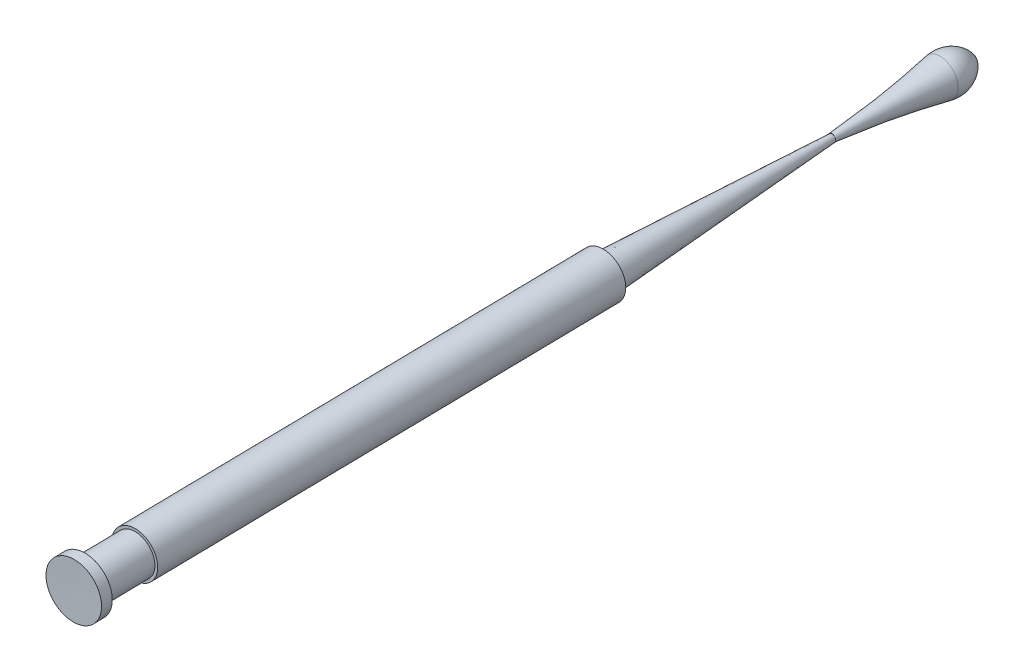
ISO-10303-21;
HEADER;
FILE_DESCRIPTION(('STEP AP214'),'2;1');
FILE_NAME('part.step','',(''),(''),'','','');
FILE_SCHEMA(('AUTOMOTIVE_DESIGN { 1 0 10303 214 1 1 1 1 }'));
ENDSEC;
DATA;
#1=APPLICATION_CONTEXT('core data for automotive mechanical design processes');
#2=APPLICATION_PROTOCOL_DEFINITION('international standard','automotive_design',2000,#1);
#3=PRODUCT_CONTEXT('',#1,'mechanical');
#4=PRODUCT('Part','Part','',(#3));
#5=PRODUCT_RELATED_PRODUCT_CATEGORY('part','',(#4));
#6=PRODUCT_DEFINITION_FORMATION('','',#4);
#7=PRODUCT_DEFINITION_CONTEXT('part definition',#1,'design');
#8=PRODUCT_DEFINITION('design','',#6,#7);
#9=PRODUCT_DEFINITION_SHAPE('','',#8);
#10=(LENGTH_UNIT() NAMED_UNIT(*) SI_UNIT(.MILLI.,.METRE.));
#11=(NAMED_UNIT(*) PLANE_ANGLE_UNIT() SI_UNIT($,.RADIAN.));
#12=(NAMED_UNIT(*) SI_UNIT($,.STERADIAN.) SOLID_ANGLE_UNIT());
#13=UNCERTAINTY_MEASURE_WITH_UNIT(LENGTH_MEASURE(1.E-05),#10,'distance_accuracy_value','');
#14=(GEOMETRIC_REPRESENTATION_CONTEXT(3) GLOBAL_UNCERTAINTY_ASSIGNED_CONTEXT((#13)) GLOBAL_UNIT_ASSIGNED_CONTEXT((#10,
#11,#12)) REPRESENTATION_CONTEXT('',''));
#15=CARTESIAN_POINT('',(0.,0.,0.));
#16=DIRECTION('',(0.,0.,1.));
#17=DIRECTION('',(1.,0.,0.));
#18=AXIS2_PLACEMENT_3D('',#15,#16,#17);
#19=CARTESIAN_POINT('',(-33.5350960608304,3.5,-10.8193182598972));
#20=DIRECTION('',(-0.016754376868981,0.,0.99985963557678));
#21=DIRECTION('',(0.99985963557678,0.,0.016754376868981));
#22=AXIS2_PLACEMENT_3D('',#19,#20,#21);
#23=TOROIDAL_SURFACE('',#22,134.673106625372,134.614867105977);
#24=CARTESIAN_POINT('',(-33.3529314814202,3.5,-21.6904483179336));
#25=DIRECTION('',(-0.016754376868981,0.,0.99985963557678));
#26=DIRECTION('',(0.99985963557678,0.,0.016754376868981));
#27=AXIS2_PLACEMENT_3D('',#24,#25,#26);
#28=CIRCLE('',#27,0.498042648166783);
#29=CARTESIAN_POINT('',(-32.8549587407225,3.5,-21.6821039237094));
#30=VERTEX_POINT('',#29);
#31=EDGE_CURVE('E12',#30,#30,#28,.T.);
#32=ORIENTED_EDGE('',*,*,#31,.F.);
#33=EDGE_LOOP('',(#32));
#34=FACE_BOUND('',#33,.T.);
#35=CARTESIAN_POINT('',(-33.1079160789345,3.5,-36.3123595328841));
#36=DIRECTION('',(-0.016754376868981,0.,0.99985963557678));
#37=DIRECTION('',(0.99985963557678,0.,0.016754376868981));
#38=AXIS2_PLACEMENT_3D('',#35,#36,#37);
#39=CIRCLE('',#38,2.49487539996673);
#40=CARTESIAN_POINT('',(-30.6133908707143,3.5,-36.2705594501919));
#41=VERTEX_POINT('',#40);
#42=EDGE_CURVE('E68',#41,#41,#39,.T.);
#43=ORIENTED_EDGE('',*,*,#42,.T.);
#44=EDGE_LOOP('',(#43));
#45=FACE_BOUND('',#44,.T.);
#46=ADVANCED_FACE('F45',(#34,#45),#23,.F.);
#47=CARTESIAN_POINT('',(-33.3529314814202,3.5,-21.6904483179336));
#48=DIRECTION('',(-0.016754376868981,0.,0.99985963557678));
#49=DIRECTION('',(0.99985963557678,0.,0.016754376868981));
#50=AXIS2_PLACEMENT_3D('',#47,#48,#49);
#51=CONICAL_SURFACE('',#50,0.49804264816678,1.55404116597575);
#52=CARTESIAN_POINT('',(-33.3527916566682,3.5,-21.6987927121578));
#53=VERTEX_POINT('',#52);
#54=VERTEX_LOOP('',#53);
#55=FACE_BOUND('',#54,.T.);
#56=ORIENTED_EDGE('',*,*,#31,.T.);
#57=EDGE_LOOP('',(#56));
#58=FACE_BOUND('',#57,.T.);
#59=ADVANCED_FACE('F58',(#55,#58),#51,.F.);
#60=CARTESIAN_POINT('',(-33.0316048623829,3.5,-40.8664235704991));
#61=CARTESIAN_POINT('',(-33.0776174097862,3.5,-40.8749001870815));
#62=CARTESIAN_POINT('',(-33.2048374657197,3.5,-40.8829255065348));
#63=CARTESIAN_POINT('',(-33.4481434067774,3.5,-40.8370640064746));
#64=CARTESIAN_POINT('',(-33.6258179463711,3.5,-40.7436186110116));
#65=CARTESIAN_POINT('',(-33.7213432338181,3.5,-40.6735113480714));
#66=B_SPLINE_CURVE_WITH_KNOTS('',3,(#60,#61,#62,#63,#64,#65),.UNSPECIFIED.,.F.,.F.,(4,1,1,4),
(0.,0.151847448223038,0.409471327777673,0.794465499432205),.UNSPECIFIED.);
#67=CARTESIAN_POINT('',(-33.3527916566682,3.5,-21.6987927121578));
#68=DIRECTION('',(-0.016754376868981,0.,0.99985963557678));
#69=AXIS1_PLACEMENT('',#67,#68);
#70=SURFACE_OF_REVOLUTION('',#66,#69);
#71=CARTESIAN_POINT('',(-33.0350301486529,3.5,-40.6620109857507));
#72=DIRECTION('',(-0.016754376868981,0.,0.99985963557678));
#73=DIRECTION('',(0.99985963557678,0.,0.016754376868981));
#74=AXIS2_PLACEMENT_3D('',#71,#72,#73);
#75=CIRCLE('',#74,0.686409432629305);
#76=CARTESIAN_POINT('',(-32.3487170634877,3.5,-40.65051062343));
#77=VERTEX_POINT('',#76);
#78=EDGE_CURVE('E52',#77,#77,#75,.T.);
#79=ORIENTED_EDGE('',*,*,#78,.F.);
#80=EDGE_LOOP('',(#79));
#81=FACE_BOUND('',#80,.T.);
#82=CARTESIAN_POINT('',(-33.0316048623829,3.5,-40.8664235704991));
#83=VERTEX_POINT('',#82);
#84=VERTEX_LOOP('',#83);
#85=FACE_BOUND('',#84,.T.);
#86=ADVANCED_FACE('F61',(#81,#85),#70,.T.);
#87=CARTESIAN_POINT('',(-33.0947518516926,3.5,-37.097967947667));
#88=DIRECTION('',(-0.016754376868981,0.,0.99985963557678));
#89=DIRECTION('',(0.99985963557678,0.,0.016754376868981));
#90=AXIS2_PLACEMENT_3D('',#87,#88,#89);
#91=DEGENERATE_TOROIDAL_SURFACE('',#90,1.7515867987389,4.31854085117791,.F.);
#92=ORIENTED_EDGE('',*,*,#42,.F.);
#93=EDGE_LOOP('',(#92));
#94=FACE_BOUND('',#93,.T.);
#95=ORIENTED_EDGE('',*,*,#78,.T.);
#96=EDGE_LOOP('',(#95));
#97=FACE_BOUND('',#96,.T.);
#98=ADVANCED_FACE('F82',(#94,#97),#91,.F.);
#99=CLOSED_SHELL('',(#46,#59,#86,#98));
#100=MANIFOLD_SOLID_BREP('B2',#99);
#101=CARTESIAN_POINT('',(-35.1073228082972,3.45823367366705,-36.4086923558426));
#102=DIRECTION('',(-0.109478747496273,1.17499877810958E-08,-0.993989136684424));
#103=DIRECTION('',(6.96705910834885E-07,-0.999999999999753,-8.8556780978676E-08));
#104=AXIS2_PLACEMENT_3D('',#101,#102,#103);
#105=ELLIPSE('',#104,0.499930018106646,0.499860046008388);
#106=CARTESIAN_POINT('',(-31.3434109134245,3.45823367356878,-37.0686212023222));
#107=DIRECTION('',(0.,-1.,0.));
#108=AXIS1_PLACEMENT('',#106,#107);
#109=SURFACE_OF_REVOLUTION('',#105,#108);
#110=CARTESIAN_POINT('',(-35.107322459993,2.95830365556053,-36.4086924001148));
#111=VERTEX_POINT('',#110);
#112=EDGE_CURVE('E44',#111,#111,#105,.T.);
#113=ORIENTED_EDGE('',*,*,#112,.T.);
#114=EDGE_LOOP('',(#113));
#115=FACE_BOUND('',#114,.T.);
#116=CARTESIAN_POINT('',(-34.2115175347418,2.95830365556053,-39.5937945752079));
#117=CARTESIAN_POINT('',(-34.2029376124153,2.95831113373052,-39.566635037028));
#118=CARTESIAN_POINT('',(-34.1913163705273,2.96012064652115,-39.5402093685468));
#119=CARTESIAN_POINT('',(-34.1684287723505,2.96652282361494,-39.5045089546453));
#120=CARTESIAN_POINT('',(-34.1598104349673,2.96930423310421,-39.4932002907601));
#121=CARTESIAN_POINT('',(-34.1408646827817,2.97615389203878,-39.4725741393137));
#122=CARTESIAN_POINT('',(-34.1305394486853,2.98022050549406,-39.4632541454191));
#123=CARTESIAN_POINT('',(-34.1102014380107,2.98880594856132,-39.4482087238986));
#124=CARTESIAN_POINT('',(-34.1003619865264,2.99317276807941,-39.4421575280359));
#125=CARTESIAN_POINT('',(-34.0800641159026,3.0025565113574,-39.4318360901468));
#126=CARTESIAN_POINT('',(-34.0696045915496,3.00757461611736,-39.4275691444036));
#127=CARTESIAN_POINT('',(-34.0438915440692,3.02028635326639,-39.4192419524533));
#128=CARTESIAN_POINT('',(-34.0284819026523,3.02821375995768,-39.4160328378565));
#129=CARTESIAN_POINT('',(-33.9976097232337,3.04456499759368,-39.4123053778331));
#130=CARTESIAN_POINT('',(-33.9821471468434,3.05298996999183,-39.4117934833376));
#131=CARTESIAN_POINT('',(-33.9525316824581,3.06946746835035,-39.4127774578941));
#132=CARTESIAN_POINT('',(-33.9383636385134,3.0775040746891,-39.4141336077689));
#133=CARTESIAN_POINT('',(-33.9103052626369,3.09366000598138,-39.4182026968826));
#134=CARTESIAN_POINT('',(-33.8964146207998,3.10177922133138,-39.4209140224564));
#135=CARTESIAN_POINT('',(-33.8688562147354,3.11808002058081,-39.427402432373));
#136=CARTESIAN_POINT('',(-33.8551894644026,3.12626172408533,-39.4311834199652));
#137=CARTESIAN_POINT('',(-33.828118712419,3.14262644330234,-39.43958599433));
#138=CARTESIAN_POINT('',(-33.8147147576041,3.15080945899136,-39.4442077294602));
#139=CARTESIAN_POINT('',(-33.7772675374525,3.17385533105774,-39.4581827414968));
#140=CARTESIAN_POINT('',(-33.7535027186997,3.18869942104872,-39.4683107724561));
#141=CARTESIAN_POINT('',(-33.7066334977926,3.21829464120957,-39.4901254065841));
#142=CARTESIAN_POINT('',(-33.6835295603262,3.23304570054843,-39.5018130751893));
#143=CARTESIAN_POINT('',(-33.6149518840084,3.2771979032417,-39.5386222261075));
#144=CARTESIAN_POINT('',(-33.5702998013532,3.3064435381117,-39.5654533263223));
#145=CARTESIAN_POINT('',(-33.4823878120202,3.36467563100678,-39.6220370382695));
#146=CARTESIAN_POINT('',(-33.4391351074515,3.39366032086473,-39.6518023029074));
#147=CARTESIAN_POINT('',(-33.3539996148282,3.45124016239345,-39.7134331320759));
#148=CARTESIAN_POINT('',(-33.3121150817158,3.47983578077405,-39.7452958512879));
#149=CARTESIAN_POINT('',(-33.2335861069451,3.53393278044009,-39.8078179393333));
#150=CARTESIAN_POINT('',(-33.1968239649101,3.55946823565365,-39.8383003419966));
#151=CARTESIAN_POINT('',(-33.1245226269919,3.6101632901228,-39.9009782625707));
#152=CARTESIAN_POINT('',(-33.0889832883629,3.63532293305405,-39.9331735793969));
#153=CARTESIAN_POINT('',(-33.0195948635995,3.68506147189257,-39.9995791303208));
#154=CARTESIAN_POINT('',(-32.9857420232147,3.70964158705692,-40.0337844822331));
#155=CARTESIAN_POINT('',(-32.9204390472991,3.75795322912154,-40.1049266639501));
#156=CARTESIAN_POINT('',(-32.8889860550942,3.78168574647402,-40.1418601398412));
#157=CARTESIAN_POINT('',(-32.8350309864369,3.82374719507798,-40.2129913484299));
#158=CARTESIAN_POINT('',(-32.811919049004,3.84230463925709,-40.2465713282278));
#159=CARTESIAN_POINT('',(-32.7807200983153,3.86869456045578,-40.2996119295977));
#160=CARTESIAN_POINT('',(-32.7709176952128,3.87723169394985,-40.3176914233116));
#161=CARTESIAN_POINT('',(-32.7528495359624,3.8936388731237,-40.354881160592));
#162=CARTESIAN_POINT('',(-32.7445842169967,3.90150872866905,-40.3739916954225));
#163=CARTESIAN_POINT('',(-32.7253253520927,3.92123347106657,-40.4265092812429));
#164=CARTESIAN_POINT('',(-32.716135900166,3.93228696414418,-40.4610216698142));
#165=CARTESIAN_POINT('',(-32.7096945192499,3.94519019996859,-40.5148978701571));
#166=CARTESIAN_POINT('',(-32.7087933365973,3.94889228753497,-40.533357792646));
#167=CARTESIAN_POINT('',(-32.7101720099318,3.95457057733461,-40.5704252243483));
#168=CARTESIAN_POINT('',(-32.7124426843814,3.95655173423567,-40.5890321531882));
#169=CARTESIAN_POINT('',(-32.7195269749117,3.95822714583862,-40.6211401039428));
#170=CARTESIAN_POINT('',(-32.7235906844671,3.95835936558647,-40.6347854127196));
#171=CARTESIAN_POINT('',(-32.7336868621762,3.95740224827341,-40.661284080887));
#172=CARTESIAN_POINT('',(-32.7397191509371,3.95631302249852,-40.674137512313));
#173=CARTESIAN_POINT('',(-32.7534935408266,3.95298682816411,-40.6986564691834));
#174=CARTESIAN_POINT('',(-32.7612291020332,3.95075420747149,-40.7103262954407));
#175=CARTESIAN_POINT('',(-32.7781037066008,3.94529000513919,-40.7323635294471));
#176=CARTESIAN_POINT('',(-32.7872456788072,3.94205632423321,-40.7427281352275));
#177=CARTESIAN_POINT('',(-32.8108908383679,3.93314602758387,-40.7663883043017));
#178=CARTESIAN_POINT('',(-32.8259705180065,3.92702248481324,-40.7789381675044));
#179=CARTESIAN_POINT('',(-32.8575013074855,3.913550874797,-40.8013350297719));
#180=CARTESIAN_POINT('',(-32.8739545495092,3.90620088538705,-40.8111777208319));
#181=CARTESIAN_POINT('',(-32.9167808422503,3.88643600012306,-40.8331493926621));
#182=CARTESIAN_POINT('',(-32.9437136129008,3.87342902307291,-40.8436436794941));
#183=CARTESIAN_POINT('',(-32.9983226473052,3.84620854866385,-40.860042188168));
#184=CARTESIAN_POINT('',(-33.026000316045,3.83199264350827,-40.8659370000937));
#185=CARTESIAN_POINT('',(-33.0987773729013,3.79374470114573,-40.8764394868541));
#186=CARTESIAN_POINT('',(-33.144001483657,3.76910857353248,-40.8779641604798));
#187=CARTESIAN_POINT('',(-33.2335358409945,3.71899924427907,-40.8732961215353));
#188=CARTESIAN_POINT('',(-33.277844001512,3.69352441506875,-40.8670874233417));
#189=CARTESIAN_POINT('',(-33.3854059547381,3.63026452487096,-40.8438530862677));
#190=CARTESIAN_POINT('',(-33.4477721475806,3.5923232867269,-40.8231140276531));
#191=CARTESIAN_POINT('',(-33.5678625240851,3.51705843091814,-40.7704747864546));
#192=CARTESIAN_POINT('',(-33.6255852226246,3.47973501385772,-40.7385710504043));
#193=CARTESIAN_POINT('',(-33.7369228616389,3.40552889217767,-40.6642776344375));
#194=CARTESIAN_POINT('',(-33.7903987799459,3.36868061549351,-40.6216454261468));
#195=CARTESIAN_POINT('',(-33.8907051939434,3.29709964368214,-40.527493534899));
#196=CARTESIAN_POINT('',(-33.9375217055198,3.26237148535326,-40.4759556388755));
#197=CARTESIAN_POINT('',(-34.0296853381826,3.19090533378004,-40.3566482527001));
#198=CARTESIAN_POINT('',(-34.0737854154178,3.1546327861746,-40.2876051150847));
#199=CARTESIAN_POINT('',(-34.12999437324,3.10453086503386,-40.1773217296384));
#200=CARTESIAN_POINT('',(-34.1470550190341,3.08856949469441,-40.1395047033919));
#201=CARTESIAN_POINT('',(-34.1773610413321,3.05837616662514,-40.061732549773));
#202=CARTESIAN_POINT('',(-34.1906114619566,3.04414193701463,-40.0217803329643));
#203=CARTESIAN_POINT('',(-34.2103676168395,3.02041465397881,-39.9477922359294));
#204=CARTESIAN_POINT('',(-34.2176806570723,3.01053637546495,-39.9140977372483));
#205=CARTESIAN_POINT('',(-34.2285786925623,2.99262677099773,-39.8455239938103));
#206=CARTESIAN_POINT('',(-34.2321568883213,2.98459883432063,-39.8106427071884));
#207=CARTESIAN_POINT('',(-34.2342127405873,2.97207076553483,-39.7450224735755));
#208=CARTESIAN_POINT('',(-34.2333284618113,2.96723593823228,-39.7143792875348));
#209=CARTESIAN_POINT('',(-34.2282661285212,2.96208233631946,-39.6686540546795));
#210=CARTESIAN_POINT('',(-34.2259668004434,2.96071509546259,-39.6534912906834));
#211=CARTESIAN_POINT('',(-34.2199149369431,2.95882355244181,-39.6234121306561));
#212=CARTESIAN_POINT('',(-34.2161617862037,2.95829960767984,-39.6084958417341));
#213=CARTESIAN_POINT('',(-34.2115175347418,2.95830365556053,-39.5937945752079));
#214=B_SPLINE_CURVE_WITH_KNOTS('',3,(#116,#117,#118,#119,#120,#121,#122,#123,#124,#125,#126,
#127,#128,#129,#130,#131,#132,#133,#134,#135,#136,#137,#138,#139,#140,#141,#142,#143,#144,#145,
#146,#147,#148,#149,#150,#151,#152,#153,#154,#155,#156,#157,#158,#159,#160,#161,#162,#163,#164,
#165,#166,#167,#168,#169,#170,#171,#172,#173,#174,#175,#176,#177,#178,#179,#180,#181,#182,#183,
#184,#185,#186,#187,#188,#189,#190,#191,#192,#193,#194,#195,#196,#197,#198,#199,#200,#201,#202,
#203,#204,#205,#206,#207,#208,#209,#210,#211,#212,#213),.UNSPECIFIED.,.T.,.F.,(4,2,2,2,2,2,2,2,
2,2,2,2,2,2,2,2,2,2,2,2,2,2,2,2,2,2,2,2,2,2,2,2,2,2,2,2,2,2,2,2,2,2,2,2,2,2,2,2,4),(0.,
0.085206321491879,0.128417850991584,0.171574594786316,0.208448829189042,0.245390888487323,
0.297961542778728,0.3506578732213,0.399619614890319,0.44852319413935,0.497607579136254,
0.546700633933778,0.636006070123901,0.725372828943215,0.904433292210309,1.08430283095376,
1.26393320361353,1.42636149050451,1.58877075130075,1.75080065015548,1.9126345650802,
2.04670359965183,2.11342377830949,2.18016290479439,2.29098532503553,2.34726672830696,
2.40338555164557,2.4458999750825,2.48841052534095,2.53076061240356,2.57320011800484,
2.63450850384706,2.69591389441809,2.79047202555921,2.88522310653068,3.03892907081036,
3.19295328804407,3.41939855173805,3.64591595353208,3.87810443446597,4.11077351006566,
4.37793987580825,4.51111027966967,4.6441035672094,4.75149849939877,4.85908861098387,
4.95177021644145,4.9978722638897,5.04399384495915),.UNSPECIFIED.);
#215=CARTESIAN_POINT('',(-34.2115175347418,2.95830365556053,-39.5937945752079));
#216=VERTEX_POINT('',#215);
#217=EDGE_CURVE('E160',#216,#216,#214,.T.);
#218=ORIENTED_EDGE('',*,*,#217,.T.);
#219=EDGE_LOOP('',(#218));
#220=FACE_BOUND('',#219,.T.);
#221=ADVANCED_FACE('F123',(#115,#220),#109,.F.);
#222=CARTESIAN_POINT('',(-35.1073228082972,3.45823367366705,-36.4086923558426));
#223=DIRECTION('',(-0.109478747496273,1.17499877810958E-08,-0.993989136684424));
#224=DIRECTION('',(1.28637394537087E-09,1.,1.16793602105839E-08));
#225=AXIS2_PLACEMENT_3D('',#222,#223,#224);
#226=CIRCLE('',#225,0.150000000000002);
#227=CARTESIAN_POINT('',(-31.3434109134245,3.45823367356878,-37.0686212023222));
#228=DIRECTION('',(0.,-1.,0.));
#229=AXIS1_PLACEMENT('',#227,#228);
#230=SURFACE_OF_REVOLUTION('',#226,#229);
#231=CARTESIAN_POINT('',(-35.1073228081043,3.60823367366705,-36.4086923540907));
#232=VERTEX_POINT('',#231);
#233=EDGE_CURVE('E131',#232,#232,#226,.T.);
#234=ORIENTED_EDGE('',*,*,#233,.F.);
#235=EDGE_LOOP('',(#234));
#236=FACE_BOUND('',#235,.T.);
#237=CARTESIAN_POINT('',(-33.2746971351343,3.60823367366705,-40.3659947579683));
#238=CARTESIAN_POINT('',(-33.2761631568824,3.60823374989698,-40.3706432111312));
#239=CARTESIAN_POINT('',(-33.2780077500646,3.60800487092069,-40.3751735682071));
#240=CARTESIAN_POINT('',(-33.282437930073,3.60706414883263,-40.3838026264533));
#241=CARTESIAN_POINT('',(-33.2850232691456,3.6063524670929,-40.3879014713238));
#242=CARTESIAN_POINT('',(-33.2908044332129,3.60448761319629,-40.3954925423545));
#243=CARTESIAN_POINT('',(-33.2939974676557,3.60333643580563,-40.3989874072163));
#244=CARTESIAN_POINT('',(-33.3008420970274,3.60067105806255,-40.4053406655813));
#245=CARTESIAN_POINT('',(-33.3044950286389,3.59915578731767,-40.4081971335657));
#246=CARTESIAN_POINT('',(-33.3181432263017,3.59322766908797,-40.4173337714625));
#247=CARTESIAN_POINT('',(-33.3289851851509,3.5880393931206,-40.4218333550955));
#248=CARTESIAN_POINT('',(-33.3490658667599,3.57792820257264,-40.4272774572942));
#249=CARTESIAN_POINT('',(-33.3582646649782,3.57310950003932,-40.4286954622736));
#250=CARTESIAN_POINT('',(-33.3766600420178,3.56321238383741,-40.4300289840542));
#251=CARTESIAN_POINT('',(-33.3858565527719,3.55813332696509,-40.429940581395));
#252=CARTESIAN_POINT('',(-33.4116088535403,3.54362664193543,-40.4280566747598));
#253=CARTESIAN_POINT('',(-33.4279802366783,3.53406653747821,-40.4249136934307));
#254=CARTESIAN_POINT('',(-33.4599448080603,3.51491486787516,-40.4159793130952));
#255=CARTESIAN_POINT('',(-33.4755361369036,3.50532328069637,-40.4101818920003));
#256=CARTESIAN_POINT('',(-33.5149258867666,3.48055206957871,-40.3924309262276));
#257=CARTESIAN_POINT('',(-33.538058439362,3.46545976846921,-40.3788690657994));
#258=CARTESIAN_POINT('',(-33.5818409470301,3.4359261529694,-40.3476227515369));
#259=CARTESIAN_POINT('',(-33.6024864920529,3.42148602256026,-40.3299311331845));
#260=CARTESIAN_POINT('',(-33.6372710273323,3.39616161814451,-40.2943939975666));
#261=CARTESIAN_POINT('',(-33.6519107390605,3.38510782984158,-40.2771599290048));
#262=CARTESIAN_POINT('',(-33.6785447084417,3.36404221334929,-40.2403041399392));
#263=CARTESIAN_POINT('',(-33.69055168876,3.35402550338336,-40.220694646654));
#264=CARTESIAN_POINT('',(-33.7086658920405,3.3375569427436,-40.1832974490055));
#265=CARTESIAN_POINT('',(-33.7154852856652,3.33080046653936,-40.1660136032614));
#266=CARTESIAN_POINT('',(-33.7228947199578,3.32198363227158,-40.1387366599417));
#267=CARTESIAN_POINT('',(-33.7248979274974,3.31925204355233,-40.1293589642287));
#268=CARTESIAN_POINT('',(-33.7275445716492,3.31447883680942,-40.1102653701662));
#269=CARTESIAN_POINT('',(-33.7281936953481,3.31243436343923,-40.1005510612261));
#270=CARTESIAN_POINT('',(-33.7275184100519,3.30941290461886,-40.0810121071359));
#271=CARTESIAN_POINT('',(-33.7262104741244,3.30842712748507,-40.0711890660648));
#272=CARTESIAN_POINT('',(-33.7221728930476,3.308174089641,-40.0569309106714));
#273=CARTESIAN_POINT('',(-33.7204604099075,3.30829964264328,-40.0522244429551));
#274=CARTESIAN_POINT('',(-33.7162691661019,3.30904152674154,-40.0432079948305));
#275=CARTESIAN_POINT('',(-33.713792042177,3.3096568139429,-40.0388971928141));
#276=CARTESIAN_POINT('',(-33.7084874702173,3.31127849776267,-40.0314169486031));
#277=CARTESIAN_POINT('',(-33.7057474691655,3.31222362883036,-40.0281719813365));
#278=CARTESIAN_POINT('',(-33.6998244635385,3.31445650316215,-40.0222503134332));
#279=CARTESIAN_POINT('',(-33.6966408257656,3.31574473857338,-40.0195744390961));
#280=CARTESIAN_POINT('',(-33.6856423788082,3.32044435590777,-40.0117649486382));
#281=CARTESIAN_POINT('',(-33.6771592797325,3.32444815252685,-40.0079237264479));
#282=CARTESIAN_POINT('',(-33.6617736536805,3.33212808719121,-40.0033657753406));
#283=CARTESIAN_POINT('',(-33.6549251609049,3.33568843364028,-40.0021536180425));
#284=CARTESIAN_POINT('',(-33.641214126647,3.34301245039035,-40.000855528163));
#285=CARTESIAN_POINT('',(-33.6343515907602,3.34677658682335,-40.0007722973732));
#286=CARTESIAN_POINT('',(-33.6141656750176,3.35806421552951,-40.001768639808));
#287=CARTESIAN_POINT('',(-33.600987269278,3.36571584787018,-40.0040457004124));
#288=CARTESIAN_POINT('',(-33.5751664843504,3.3810644028974,-40.0105600788745));
#289=CARTESIAN_POINT('',(-33.5625258341993,3.38876139258784,-40.0148032644519));
#290=CARTESIAN_POINT('',(-33.5366343921206,3.40480963843409,-40.0251225384854));
#291=CARTESIAN_POINT('',(-33.5234339680832,3.41315615701945,-40.0313310385049));
#292=CARTESIAN_POINT('',(-33.4976202394637,3.42974178525403,-40.0449910226033));
#293=CARTESIAN_POINT('',(-33.4850074692293,3.4379807924266,-40.0524436107547));
#294=CARTESIAN_POINT('',(-33.4479712673565,3.46252665052722,-40.076358875085));
#295=CARTESIAN_POINT('',(-33.4243917805107,3.47863610667197,-40.0943606481089));
#296=CARTESIAN_POINT('',(-33.3842928333144,3.50689063744084,-40.1299205297803));
#297=CARTESIAN_POINT('',(-33.3673059044882,3.51918279394186,-40.1468434492889));
#298=CARTESIAN_POINT('',(-33.3356038304416,3.5429304194666,-40.183074207399));
#299=CARTESIAN_POINT('',(-33.3208766658131,3.55439013136889,-40.2023683695956));
#300=CARTESIAN_POINT('',(-33.2983034522816,3.57314926434758,-40.2388177218731));
#301=CARTESIAN_POINT('',(-33.2896595374036,3.58076662224797,-40.2552740050143));
#302=CARTESIAN_POINT('',(-33.2794679343799,3.59096657414631,-40.2816942740911));
#303=CARTESIAN_POINT('',(-33.2765227849308,3.594179770453,-40.290858709108));
#304=CARTESIAN_POINT('',(-33.2720860783738,3.59990532631985,-40.3097606738959));
#305=CARTESIAN_POINT('',(-33.2705896825461,3.60241999868302,-40.3194961799617));
#306=CARTESIAN_POINT('',(-33.2699590298694,3.60554859047423,-40.3355115506278));
#307=CARTESIAN_POINT('',(-33.2701398038664,3.60652162813656,-40.3416875751545));
#308=CARTESIAN_POINT('',(-33.2715786508756,3.60786260539159,-40.3539709591141));
#309=CARTESIAN_POINT('',(-33.2728312775907,3.60823357664654,-40.3600785078094));
#310=CARTESIAN_POINT('',(-33.2746971351343,3.60823367366705,-40.3659947579683));
#311=B_SPLINE_CURVE_WITH_KNOTS('',3,(#237,#238,#239,#240,#241,#242,#243,#244,#245,#246,#247,
#248,#249,#250,#251,#252,#253,#254,#255,#256,#257,#258,#259,#260,#261,#262,#263,#264,#265,#266,
#267,#268,#269,#270,#271,#272,#273,#274,#275,#276,#277,#278,#279,#280,#281,#282,#283,#284,#285,
#286,#287,#288,#289,#290,#291,#292,#293,#294,#295,#296,#297,#298,#299,#300,#301,#302,#303,#304,
#305,#306,#307,#308,#309,#310),.UNSPECIFIED.,.T.,.F.,(4,2,2,2,2,2,2,2,2,2,2,2,2,2,2,2,2,2,2,2,2,
2,2,2,2,2,2,2,2,2,2,2,2,2,2,2,4),(0.,0.0145984966593997,0.0291921163180655,0.0437202716644587,
0.0582916722487097,0.0960388982931029,0.12738467626774,0.158812023963596,0.216152597989201,
0.273623909277733,0.365453087278879,0.457442775089015,0.532726344778889,0.607637670928283,
0.666567260693052,0.696390747324975,0.726088722470396,0.75553812443742,0.770486715069125,
0.78540352703858,0.798380531650615,0.811376251608561,0.841165519472571,0.864525307246642,
0.887940990751795,0.933915205774552,0.980027519196328,1.03036898105267,1.08075535855007,
1.18168479164043,1.26237090172165,1.34261174986506,1.40249842443594,1.43285746010117,
1.46311474562402,1.48178909522112,1.50036911639283),.UNSPECIFIED.);
#312=CARTESIAN_POINT('',(-33.2746971351343,3.60823367366705,-40.3659947579683));
#313=VERTEX_POINT('',#312);
#314=EDGE_CURVE('E154',#313,#313,#311,.T.);
#315=ORIENTED_EDGE('',*,*,#314,.F.);
#316=EDGE_LOOP('',(#315));
#317=FACE_BOUND('',#316,.T.);
#318=ADVANCED_FACE('F148',(#236,#317),#230,.T.);
#319=CARTESIAN_POINT('',(-168.189299373268,3.45823367356878,-13.0756822424152));
#320=DIRECTION('',(0.,-1.,0.));
#321=AXIS1_PLACEMENT('',#319,#320);
#322=SURFACE_OF_REVOLUTION('',#226,#321);
#323=ORIENTED_EDGE('',*,*,#233,.T.);
#324=EDGE_LOOP('',(#323));
#325=FACE_BOUND('',#324,.T.);
#326=CARTESIAN_POINT('',(-33.35279165666,3.45823367366705,-21.6987927126486));
#327=DIRECTION('',(0.,1.17499877810958E-08,-1.));
#328=DIRECTION('',(0.,1.,1.17499877810958E-08));
#329=AXIS2_PLACEMENT_3D('',#326,#327,#328);
#330=CIRCLE('',#329,0.150000000000002);
#331=CARTESIAN_POINT('',(-33.35279165666,3.60823367366705,-21.6987927108861));
#332=VERTEX_POINT('',#331);
#333=EDGE_CURVE('E139',#332,#332,#330,.T.);
#334=ORIENTED_EDGE('',*,*,#333,.F.);
#335=EDGE_LOOP('',(#334));
#336=FACE_BOUND('',#335,.T.);
#337=ADVANCED_FACE('F145',(#325,#336),#322,.F.);
#338=CARTESIAN_POINT('',(-168.189299373268,3.45823367356878,-13.0756822424152));
#339=DIRECTION('',(0.,-1.,0.));
#340=AXIS1_PLACEMENT('',#338,#339);
#341=SURFACE_OF_REVOLUTION('',#105,#340);
#342=ORIENTED_EDGE('',*,*,#112,.F.);
#343=EDGE_LOOP('',(#342));
#344=FACE_BOUND('',#343,.T.);
#345=CARTESIAN_POINT('',(-33.35279165666,3.45823367366705,-21.6987927126486));
#346=DIRECTION('',(0.,1.17499877810958E-08,-1.));
#347=DIRECTION('',(7.0221319229755E-07,-0.999999999999753,-1.17499877810929E-08));
#348=AXIS2_PLACEMENT_3D('',#345,#346,#347);
#349=ELLIPSE('',#348,0.499930018106646,0.499860046008388);
#350=CARTESIAN_POINT('',(-33.3527913056026,2.95830365556053,-21.6987927185227));
#351=VERTEX_POINT('',#350);
#352=EDGE_CURVE('E135',#351,#351,#349,.T.);
#353=ORIENTED_EDGE('',*,*,#352,.T.);
#354=EDGE_LOOP('',(#353));
#355=FACE_BOUND('',#354,.T.);
#356=ADVANCED_FACE('F152',(#344,#355),#341,.T.);
#357=CARTESIAN_POINT('',(-33.35279165666,3.45823367366705,-21.6987927126486));
#358=DIRECTION('',(0.,1.17499877810958E-08,-1.));
#359=DIRECTION('',(0.,1.,1.17499877810958E-08));
#360=AXIS2_PLACEMENT_3D('',#357,#358,#359);
#361=PLANE('',#360);
#362=ORIENTED_EDGE('',*,*,#333,.T.);
#363=EDGE_LOOP('',(#362));
#364=FACE_BOUND('',#363,.T.);
#365=ORIENTED_EDGE('',*,*,#352,.F.);
#366=EDGE_LOOP('',(#365));
#367=FACE_BOUND('',#366,.T.);
#368=ADVANCED_FACE('F166',(#364,#367),#361,.F.);
#369=CARTESIAN_POINT('',(-47.29103221977,-15.4287724516127,24.8129263991742));
#370=DIRECTION('',(0.476843512199102,-0.866025403784438,-0.150400348648619));
#371=DIRECTION('',(0.875989633236581,0.482329931128102,0.));
#372=AXIS2_PLACEMENT_3D('',#369,#370,#371);
#373=PLANE('',#372);
#374=ORIENTED_EDGE('',*,*,#217,.F.);
#375=EDGE_LOOP('',(#374));
#376=FACE_BOUND('',#375,.T.);
#377=ORIENTED_EDGE('',*,*,#314,.T.);
#378=EDGE_LOOP('',(#377));
#379=FACE_BOUND('',#378,.T.);
#380=ADVANCED_FACE('F163',(#376,#379),#373,.T.);
#381=CLOSED_SHELL('',(#221,#318,#337,#356,#368,#380));
#382=MANIFOLD_SOLID_BREP('B6',#381);
#383=CARTESIAN_POINT('',(-33.35279165666,3.45823367356878,-21.6904286580932));
#384=DIRECTION('',(0.0167304507679107,0.,0.999860036213621));
#385=DIRECTION('',(0.999860036213621,0.,-0.0167304507679107));
#386=AXIS2_PLACEMENT_3D('',#383,#384,#385);
#387=CONICAL_SURFACE('',#386,0.499930018106645,1.55406509543088);
#388=CARTESIAN_POINT('',(-33.3529316106516,3.45823367356878,-21.6987927126486));
#389=VERTEX_POINT('',#388);
#390=VERTEX_LOOP('',#389);
#391=FACE_BOUND('',#390,.T.);
#392=CARTESIAN_POINT('',(-33.35279165666,3.45823367356878,-21.6904286580932));
#393=DIRECTION('',(-0.0167304507679107,0.,-0.999860036213621));
#394=DIRECTION('',(-0.999860036213621,0.,0.0167304507679107));
#395=AXIS2_PLACEMENT_3D('',#392,#393,#394);
#396=CIRCLE('',#395,0.499930018106646);
#397=CARTESIAN_POINT('',(-32.8529316106517,3.45823367356878,-21.6987927126486));
#398=VERTEX_POINT('',#397);
#399=EDGE_CURVE('E121',#398,#398,#396,.T.);
#400=ORIENTED_EDGE('',*,*,#399,.T.);
#401=EDGE_LOOP('',(#400));
#402=FACE_BOUND('',#401,.T.);
#403=ADVANCED_FACE('F227',(#391,#402),#387,.T.);
#404=CARTESIAN_POINT('',(-32.8177741432606,3.45823367356878,10.2837624586542));
#405=DIRECTION('',(0.0167304507679107,0.,0.999860036213621));
#406=DIRECTION('',(0.999860036213621,0.,-0.0167304507679107));
#407=AXIS2_PLACEMENT_3D('',#404,#405,#406);
#408=CONICAL_SURFACE('',#407,2.29127121935524,0.0559582753425584);
#409=CARTESIAN_POINT('',(-32.8177741432606,3.45823367356878,10.2837624586542));
#410=DIRECTION('',(-0.0167304507679107,0.,-0.999860036213621));
#411=DIRECTION('',(-0.999860036213621,0.,0.0167304507679107));
#412=AXIS2_PLACEMENT_3D('',#409,#410,#411);
#413=CIRCLE('',#412,2.29127121935524);
#414=CARTESIAN_POINT('',(-30.5268236189008,3.45823367356878,10.2454284583228));
#415=VERTEX_POINT('',#414);
#416=EDGE_CURVE('E234',#415,#415,#413,.T.);
#417=CARTESIAN_POINT('',(-32.8529316106517,3.45823367356878,-21.6987927126486));
#418=CARTESIAN_POINT('',(-32.8287013190709,3.45823367356878,-21.3660404087843));
#419=CARTESIAN_POINT('',(-32.8044710274902,3.45823367356878,-21.03328810492));
#420=CARTESIAN_POINT('',(-32.7560104443287,3.45823367356878,-20.3677834971914));
#421=CARTESIAN_POINT('',(-32.731780152748,3.45823367356878,-20.0350311933271));
#422=CARTESIAN_POINT('',(-32.6833195695865,3.45823367356878,-19.3695265855986));
#423=CARTESIAN_POINT('',(-32.6590892780057,3.45823367356878,-19.0367742817343));
#424=CARTESIAN_POINT('',(-32.6106286948443,3.45823367356878,-18.3712696740057));
#425=CARTESIAN_POINT('',(-32.5863984032635,3.45823367356878,-18.0385173701414));
#426=CARTESIAN_POINT('',(-32.5379378201021,3.45823367356878,-17.3730127624129));
#427=CARTESIAN_POINT('',(-32.5137075285213,3.45823367356878,-17.0402604585486));
#428=CARTESIAN_POINT('',(-32.4652469453598,3.45823367356878,-16.37475585082));
#429=CARTESIAN_POINT('',(-32.4410166537791,3.45823367356878,-16.0420035469557));
#430=CARTESIAN_POINT('',(-32.3925560706176,3.45823367356878,-15.3764989392272));
#431=CARTESIAN_POINT('',(-32.3683257790369,3.45823367356878,-15.0437466353629));
#432=CARTESIAN_POINT('',(-32.3198651958754,3.45823367356878,-14.3782420276343));
#433=CARTESIAN_POINT('',(-32.2956349042947,3.45823367356878,-14.04548972377));
#434=CARTESIAN_POINT('',(-32.2471743211332,3.45823367356878,-13.3799851160414));
#435=CARTESIAN_POINT('',(-32.2229440295525,3.45823367356878,-13.0472328121772));
#436=CARTESIAN_POINT('',(-32.174483446391,3.45823367356878,-12.3817282044486));
#437=CARTESIAN_POINT('',(-32.1502531548102,3.45823367356878,-12.0489759005843));
#438=CARTESIAN_POINT('',(-32.1017925716488,3.45823367356878,-11.3834712928557));
#439=CARTESIAN_POINT('',(-32.077562280068,3.45823367356878,-11.0507189889914));
#440=CARTESIAN_POINT('',(-32.0291016969066,3.45823367356878,-10.3852143812629));
#441=CARTESIAN_POINT('',(-32.0048714053258,3.45823367356878,-10.0524620773986));
#442=CARTESIAN_POINT('',(-31.9564108221643,3.45823367356878,-9.38695746967002));
#443=CARTESIAN_POINT('',(-31.9321805305836,3.45823367356878,-9.05420516580574));
#444=CARTESIAN_POINT('',(-31.8837199474221,3.45823367356878,-8.38870055807717));
#445=CARTESIAN_POINT('',(-31.8594896558414,3.45823367356878,-8.05594825421288));
#446=CARTESIAN_POINT('',(-31.8110290726799,3.45823367356878,-7.39044364648431));
#447=CARTESIAN_POINT('',(-31.7867987810992,3.45823367356878,-7.05769134262003));
#448=CARTESIAN_POINT('',(-31.7383381979377,3.45823367356878,-6.39218673489146));
#449=CARTESIAN_POINT('',(-31.714107906357,3.45823367356878,-6.05943443102717));
#450=CARTESIAN_POINT('',(-31.6656473231955,3.45823367356878,-5.3939298232986));
#451=CARTESIAN_POINT('',(-31.6414170316148,3.45823367356878,-5.06117751943432));
#452=CARTESIAN_POINT('',(-31.5929564484533,3.45823367356878,-4.39567291170574));
#453=CARTESIAN_POINT('',(-31.5687261568725,3.45823367356878,-4.06292060784146));
#454=CARTESIAN_POINT('',(-31.5202655737111,3.45823367356878,-3.39741600011289));
#455=CARTESIAN_POINT('',(-31.4960352821303,3.45823367356878,-3.06466369624861));
#456=CARTESIAN_POINT('',(-31.4475746989688,3.45823367356878,-2.39915908852004));
#457=CARTESIAN_POINT('',(-31.4233444073881,3.45823367356878,-2.06640678465575));
#458=CARTESIAN_POINT('',(-31.3748838242266,3.45823367356878,-1.40090217692718));
#459=CARTESIAN_POINT('',(-31.3506535326459,3.45823367356878,-1.06814987306289));
#460=CARTESIAN_POINT('',(-31.3021929494844,3.45823367356878,-0.402645265334323));
#461=CARTESIAN_POINT('',(-31.2779626579037,3.45823367356878,-0.0698929614700387));
#462=CARTESIAN_POINT('',(-31.2295020747422,3.45823367356878,0.595611646258531));
#463=CARTESIAN_POINT('',(-31.2052717831615,3.45823367356878,0.928363950122815));
#464=CARTESIAN_POINT('',(-31.1568112,3.45823367356878,1.59386855785139));
#465=CARTESIAN_POINT('',(-31.1325809084193,3.45823367356878,1.92662086171567));
#466=CARTESIAN_POINT('',(-31.0841203252578,3.45823367356878,2.59212546944424));
#467=CARTESIAN_POINT('',(-31.059890033677,3.45823367356878,2.92487777330853));
#468=CARTESIAN_POINT('',(-31.0114294505156,3.45823367356878,3.5903823810371));
#469=CARTESIAN_POINT('',(-30.9871991589348,3.45823367356878,3.92313468490138));
#470=CARTESIAN_POINT('',(-30.9387385757733,3.45823367356878,4.58863929262996));
#471=CARTESIAN_POINT('',(-30.9145082841926,3.45823367356878,4.92139159649424));
#472=CARTESIAN_POINT('',(-30.8660477010311,3.45823367356878,5.58689620422281));
#473=CARTESIAN_POINT('',(-30.8418174094504,3.45823367356878,5.91964850808709));
#474=CARTESIAN_POINT('',(-30.7933568262889,3.45823367356878,6.58515311581566));
#475=CARTESIAN_POINT('',(-30.7691265347082,3.45823367356878,6.91790541967995));
#476=CARTESIAN_POINT('',(-30.7206659515467,3.45823367356878,7.58341002740852));
#477=CARTESIAN_POINT('',(-30.696435659966,3.45823367356878,7.91616233127281));
#478=CARTESIAN_POINT('',(-30.6479750768045,3.45823367356878,8.58166693900137));
#479=CARTESIAN_POINT('',(-30.6237447852238,3.45823367356878,8.91441924286566));
#480=CARTESIAN_POINT('',(-30.5752842020623,3.45823367356878,9.57992385059423));
#481=CARTESIAN_POINT('',(-30.5510539104815,3.45823367356878,9.91267615445852));
#482=CARTESIAN_POINT('',(-30.5268236189008,3.45823367356878,10.2454284583228));
#483=B_SPLINE_CURVE_WITH_KNOTS('',3,(#417,#418,#419,#420,#421,#422,#423,#424,#425,#426,#427,
#428,#429,#430,#431,#432,#433,#434,#435,#436,#437,#438,#439,#440,#441,#442,#443,#444,#445,#446,
#447,#448,#449,#450,#451,#452,#453,#454,#455,#456,#457,#458,#459,#460,#461,#462,#463,#464,#465,
#466,#467,#468,#469,#470,#471,#472,#473,#474,#475,#476,#477,#478,#479,#480,#481,#482),
.UNSPECIFIED.,.F.,.F.,(4,2,2,2,2,2,2,2,2,2,2,2,2,2,2,2,2,2,2,2,2,2,2,2,2,2,2,2,2,2,2,2,4),(0.,
1.00090000740019,2.00180001480038,3.00270002220056,4.00360002960075,5.00450003700094,
6.00540004440112,7.00630005180131,8.0072000592015,9.00810006660168,10.0090000740019,
11.0099000814021,12.0108000888022,13.0117000962024,14.0126001036026,15.0135001110028,
16.014400118403,17.0153001258032,18.0162001332034,19.0171001406035,20.0180001480037,
21.0189001554039,22.0198001628041,23.0207001702043,24.0216001776045,25.0225001850047,
26.0234001924049,27.024300199805,28.0252002072052,29.0261002146054,30.0270002220056,
31.0279002294058,32.028800236806),.UNSPECIFIED.);
#484=EDGE_CURVE('BSEAM253',#398,#415,#483,.T.);
#485=ORIENTED_EDGE('',*,*,#399,.F.);
#486=ORIENTED_EDGE('',*,*,#416,.T.);
#487=ORIENTED_EDGE('',*,*,#484,.T.);
#488=ORIENTED_EDGE('',*,*,#484,.F.);
#489=EDGE_LOOP('',(#485,#487,#486,#488));
#490=FACE_BOUND('',#489,.T.);
#491=ADVANCED_FACE('F253',(#490),#408,.T.);
#492=CARTESIAN_POINT('',(-32.8175477419309,3.45823367356878,10.2972928557033));
#493=DIRECTION('',(0.0167304507679107,0.,0.999860036213621));
#494=DIRECTION('',(0.999860036213621,0.,-0.0167304507679107));
#495=AXIS2_PLACEMENT_3D('',#492,#493,#494);
#496=CONICAL_SURFACE('',#495,3.1,1.55406509543087);
#497=ORIENTED_EDGE('',*,*,#416,.F.);
#498=EDGE_LOOP('',(#497));
#499=FACE_BOUND('',#498,.T.);
#500=CARTESIAN_POINT('',(-32.8175477419309,3.45823367356878,10.2972928557033));
#501=DIRECTION('',(-0.0167304507679107,0.,-0.999860036213621));
#502=DIRECTION('',(-0.999860036213621,0.,0.0167304507679107));
#503=AXIS2_PLACEMENT_3D('',#500,#501,#502);
#504=CIRCLE('',#503,3.1);
#505=CARTESIAN_POINT('',(-35.9171138541931,3.45823367356878,10.3491572530838));
#506=VERTEX_POINT('',#505);
#507=EDGE_CURVE('E265',#506,#506,#504,.T.);
#508=ORIENTED_EDGE('',*,*,#507,.T.);
#509=EDGE_LOOP('',(#508));
#510=FACE_BOUND('',#509,.T.);
#511=ADVANCED_FACE('F257',(#499,#510),#496,.T.);
#512=CARTESIAN_POINT('',(-32.8043300957383,3.45823367356878,11.08721754955));
#513=DIRECTION('',(-0.0167304507679107,0.,-0.999860036213621));
#514=DIRECTION('',(-0.999860036213621,0.,0.0167304507679107));
#515=AXIS2_PLACEMENT_3D('',#512,#513,#514);
#516=CYLINDRICAL_SURFACE('',#515,3.1);
#517=ORIENTED_EDGE('',*,*,#507,.F.);
#518=EDGE_LOOP('',(#517));
#519=FACE_BOUND('',#518,.T.);
#520=CARTESIAN_POINT('',(-31.7243541638974,3.45823367356878,75.6296969662691));
#521=DIRECTION('',(-0.0167304507679107,0.,-0.999860036213621));
#522=DIRECTION('',(-0.999860036213621,0.,0.0167304507679107));
#523=AXIS2_PLACEMENT_3D('',#520,#521,#522);
#524=CIRCLE('',#523,3.1);
#525=CARTESIAN_POINT('',(-34.8239202761596,3.45823367356878,75.6815613636496));
#526=VERTEX_POINT('',#525);
#527=EDGE_CURVE('E267',#526,#526,#524,.T.);
#528=ORIENTED_EDGE('',*,*,#527,.T.);
#529=EDGE_LOOP('',(#528));
#530=FACE_BOUND('',#529,.T.);
#531=ADVANCED_FACE('F300',(#519,#530),#516,.T.);
#532=CARTESIAN_POINT('',(-31.7244591440844,3.45823367356878,75.6234230472311));
#533=DIRECTION('',(0.0167304507679107,0.,0.999860036213621));
#534=DIRECTION('',(0.999860036213621,0.,-0.0167304507679107));
#535=AXIS2_PLACEMENT_3D('',#532,#533,#534);
#536=CONICAL_SURFACE('',#535,2.725,1.55406509543086);
#537=ORIENTED_EDGE('',*,*,#527,.F.);
#538=EDGE_LOOP('',(#537));
#539=FACE_BOUND('',#538,.T.);
#540=CARTESIAN_POINT('',(-31.7244591440844,3.45823367356878,75.6234230472311));
#541=DIRECTION('',(-0.0167304507679107,0.,-0.999860036213621));
#542=DIRECTION('',(-0.999860036213621,0.,0.0167304507679107));
#543=AXIS2_PLACEMENT_3D('',#540,#541,#542);
#544=CIRCLE('',#543,2.725);
#545=CARTESIAN_POINT('',(-34.4490777427665,3.45823367356878,75.6690135255737));
#546=VERTEX_POINT('',#545);
#547=EDGE_CURVE('E272',#546,#546,#544,.T.);
#548=ORIENTED_EDGE('',*,*,#547,.T.);
#549=EDGE_LOOP('',(#548));
#550=FACE_BOUND('',#549,.T.);
#551=ADVANCED_FACE('F293',(#539,#550),#536,.F.);
#552=CARTESIAN_POINT('',(-32.8043300957383,3.45823367356878,11.08721754955));
#553=DIRECTION('',(-0.0167304507679107,0.,-0.999860036213621));
#554=DIRECTION('',(-0.999860036213621,0.,0.0167304507679107));
#555=AXIS2_PLACEMENT_3D('',#552,#553,#554);
#556=CYLINDRICAL_SURFACE('',#555,2.725);
#557=ORIENTED_EDGE('',*,*,#547,.F.);
#558=EDGE_LOOP('',(#557));
#559=FACE_BOUND('',#558,.T.);
#560=CARTESIAN_POINT('',(-31.607345988709,3.45823367356878,82.6224433007264));
#561=DIRECTION('',(-0.0167304507679107,0.,-0.999860036213621));
#562=DIRECTION('',(-0.999860036213621,0.,0.0167304507679107));
#563=AXIS2_PLACEMENT_3D('',#560,#561,#562);
#564=CIRCLE('',#563,2.725);
#565=CARTESIAN_POINT('',(-34.3319645873911,3.45823367356878,82.668033779069));
#566=VERTEX_POINT('',#565);
#567=EDGE_CURVE('E275',#566,#566,#564,.T.);
#568=ORIENTED_EDGE('',*,*,#567,.T.);
#569=EDGE_LOOP('',(#568));
#570=FACE_BOUND('',#569,.T.);
#571=ADVANCED_FACE('F287',(#559,#570),#556,.T.);
#572=CARTESIAN_POINT('',(-31.6070590428645,3.45823367356878,82.6395920127636));
#573=DIRECTION('',(0.0167304507679107,0.,0.999860036213621));
#574=DIRECTION('',(0.999860036213621,0.,-0.0167304507679107));
#575=AXIS2_PLACEMENT_3D('',#572,#573,#574);
#576=CONICAL_SURFACE('',#575,3.75,1.55406509543086);
#577=ORIENTED_EDGE('',*,*,#567,.F.);
#578=EDGE_LOOP('',(#577));
#579=FACE_BOUND('',#578,.T.);
#580=CARTESIAN_POINT('',(-31.6070590428645,3.45823367356878,82.6395920127636));
#581=DIRECTION('',(-0.0167304507679107,0.,-0.999860036213621));
#582=DIRECTION('',(-0.999860036213621,0.,0.0167304507679107));
#583=AXIS2_PLACEMENT_3D('',#580,#581,#582);
#584=CIRCLE('',#583,3.75);
#585=CARTESIAN_POINT('',(-35.3565341786656,3.45823367356878,82.7023312031432));
#586=VERTEX_POINT('',#585);
#587=EDGE_CURVE('E278',#586,#586,#584,.T.);
#588=ORIENTED_EDGE('',*,*,#587,.T.);
#589=EDGE_LOOP('',(#588));
#590=FACE_BOUND('',#589,.T.);
#591=ADVANCED_FACE('F248',(#579,#590),#576,.T.);
#592=CARTESIAN_POINT('',(-32.8043300957383,3.45823367356878,11.08721754955));
#593=DIRECTION('',(-0.0167304507679107,0.,-0.999860036213621));
#594=DIRECTION('',(-0.999860036213621,0.,0.0167304507679107));
#595=AXIS2_PLACEMENT_3D('',#592,#593,#594);
#596=CYLINDRICAL_SURFACE('',#595,3.75);
#597=ORIENTED_EDGE('',*,*,#587,.F.);
#598=EDGE_LOOP('',(#597));
#599=FACE_BOUND('',#598,.T.);
#600=CARTESIAN_POINT('',(-31.5819633667126,3.45823367356878,84.139382067084));
#601=DIRECTION('',(-0.0167304507679107,0.,-0.999860036213621));
#602=DIRECTION('',(-0.999860036213621,0.,0.0167304507679107));
#603=AXIS2_PLACEMENT_3D('',#600,#601,#602);
#604=CIRCLE('',#603,3.75);
#605=CARTESIAN_POINT('',(-35.3314385025137,3.45823367356878,84.2021212574637));
#606=VERTEX_POINT('',#605);
#607=EDGE_CURVE('E281',#606,#606,#604,.T.);
#608=ORIENTED_EDGE('',*,*,#607,.T.);
#609=EDGE_LOOP('',(#608));
#610=FACE_BOUND('',#609,.T.);
#611=ADVANCED_FACE('F242',(#599,#610),#596,.T.);
#612=CARTESIAN_POINT('',(-31.5830131685828,3.45823367356878,84.0766428767043));
#613=DIRECTION('',(0.0167304507679107,0.,0.999860036213621));
#614=DIRECTION('',(0.999860036213621,0.,-0.0167304507679107));
#615=AXIS2_PLACEMENT_3D('',#612,#613,#614);
#616=CONICAL_SURFACE('',#615,0.,1.55406509543088);
#617=ORIENTED_EDGE('',*,*,#607,.F.);
#618=EDGE_LOOP('',(#617));
#619=FACE_BOUND('',#618,.T.);
#620=CARTESIAN_POINT('',(-31.5830131685828,3.45823367356878,84.0766428767043));
#621=VERTEX_POINT('',#620);
#622=VERTEX_LOOP('',#621);
#623=FACE_BOUND('',#622,.T.);
#624=ADVANCED_FACE('F240',(#619,#623),#616,.F.);
#625=CLOSED_SHELL('',(#403,#491,#511,#531,#551,#571,#591,#611,#624));
#626=MANIFOLD_SOLID_BREP('B39',#625);
#627=ADVANCED_BREP_SHAPE_REPRESENTATION('',(#18,#100,#382,#626),#14);
#628=SHAPE_DEFINITION_REPRESENTATION(#9,#627);
ENDSEC;
END-ISO-10303-21;
